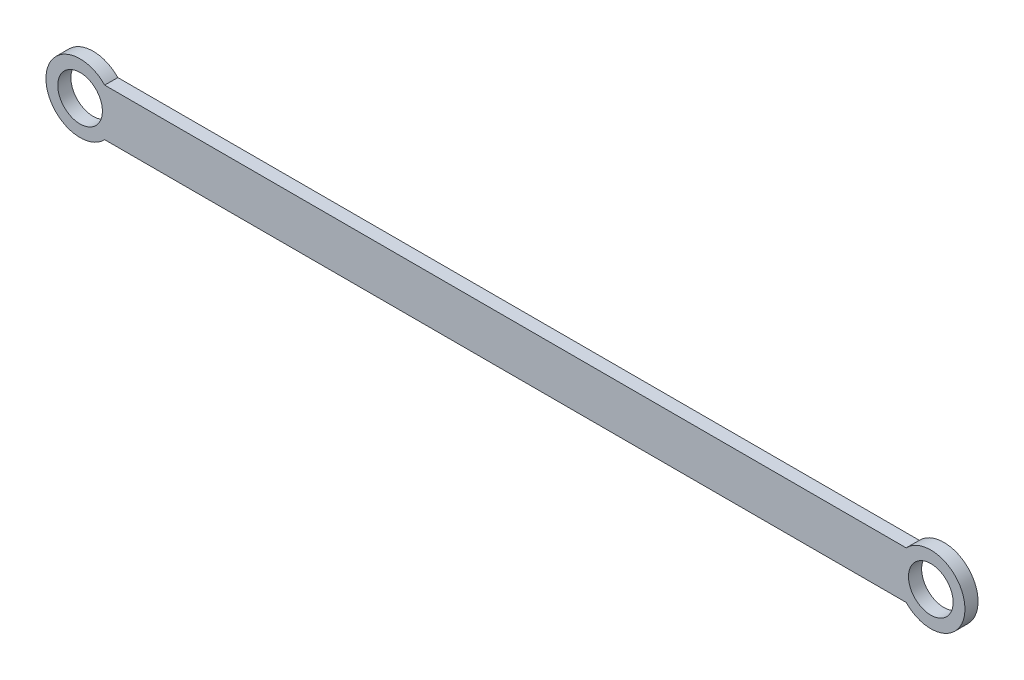
ISO-10303-21;
HEADER;
FILE_DESCRIPTION(('STEP AP214'),'2;1');
FILE_NAME('part.step','',(''),(''),'','','');
FILE_SCHEMA(('AUTOMOTIVE_DESIGN { 1 0 10303 214 1 1 1 1 }'));
ENDSEC;
DATA;
#1=APPLICATION_CONTEXT('core data for automotive mechanical design processes');
#2=APPLICATION_PROTOCOL_DEFINITION('international standard','automotive_design',2000,#1);
#3=PRODUCT_CONTEXT('',#1,'mechanical');
#4=PRODUCT('Part','Part','',(#3));
#5=PRODUCT_RELATED_PRODUCT_CATEGORY('part','',(#4));
#6=PRODUCT_DEFINITION_FORMATION('','',#4);
#7=PRODUCT_DEFINITION_CONTEXT('part definition',#1,'design');
#8=PRODUCT_DEFINITION('design','',#6,#7);
#9=PRODUCT_DEFINITION_SHAPE('','',#8);
#10=(LENGTH_UNIT() NAMED_UNIT(*) SI_UNIT(.MILLI.,.METRE.));
#11=(NAMED_UNIT(*) PLANE_ANGLE_UNIT() SI_UNIT($,.RADIAN.));
#12=(NAMED_UNIT(*) SI_UNIT($,.STERADIAN.) SOLID_ANGLE_UNIT());
#13=UNCERTAINTY_MEASURE_WITH_UNIT(LENGTH_MEASURE(1.E-05),#10,'distance_accuracy_value','');
#14=(GEOMETRIC_REPRESENTATION_CONTEXT(3) GLOBAL_UNCERTAINTY_ASSIGNED_CONTEXT((#13)) GLOBAL_UNIT_ASSIGNED_CONTEXT((#10,
#11,#12)) REPRESENTATION_CONTEXT('',''));
#15=CARTESIAN_POINT('',(0.,0.,0.));
#16=DIRECTION('',(0.,0.,1.));
#17=DIRECTION('',(1.,0.,0.));
#18=AXIS2_PLACEMENT_3D('',#15,#16,#17);
#19=CARTESIAN_POINT('',(0.,0.,2.5));
#20=DIRECTION('',(0.,0.,1.));
#21=DIRECTION('',(1.,0.,0.));
#22=AXIS2_PLACEMENT_3D('',#19,#20,#21);
#23=PLANE('',#22);
#24=CARTESIAN_POINT('',(0.,0.,2.5));
#25=DIRECTION('',(0.,0.,1.));
#26=DIRECTION('',(1.,0.,0.));
#27=AXIS2_PLACEMENT_3D('',#24,#25,#26);
#28=CIRCLE('',#27,4.25);
#29=CARTESIAN_POINT('',(4.25,0.,2.5));
#30=VERTEX_POINT('',#29);
#31=EDGE_CURVE('E112',#30,#30,#28,.T.);
#32=ORIENTED_EDGE('',*,*,#31,.F.);
#33=EDGE_LOOP('',(#32));
#34=FACE_BOUND('',#33,.T.);
#35=CARTESIAN_POINT('',(0.,0.,2.5));
#36=DIRECTION('',(0.,0.,1.));
#37=DIRECTION('',(1.,0.,0.));
#38=AXIS2_PLACEMENT_3D('',#35,#36,#37);
#39=CIRCLE('',#38,6.5);
#40=CARTESIAN_POINT('',(4.69041575982343,4.5,2.5));
#41=VERTEX_POINT('',#40);
#42=CARTESIAN_POINT('',(4.69041575982343,-4.5,2.5));
#43=VERTEX_POINT('',#42);
#44=EDGE_CURVE('E92',#41,#43,#39,.T.);
#45=ORIENTED_EDGE('',*,*,#44,.T.);
#46=DIRECTION('',(1.,0.,0.));
#47=VECTOR('',#46,1.);
#48=CARTESIAN_POINT('',(4.69041575982343,-4.5,2.5));
#49=LINE('',#48,#47);
#50=CARTESIAN_POINT('',(157.309584240177,-4.5,2.5));
#51=VERTEX_POINT('',#50);
#52=EDGE_CURVE('E87',#43,#51,#49,.T.);
#53=ORIENTED_EDGE('',*,*,#52,.T.);
#54=CARTESIAN_POINT('',(162.,0.,2.5));
#55=DIRECTION('',(0.,0.,1.));
#56=DIRECTION('',(1.,0.,0.));
#57=AXIS2_PLACEMENT_3D('',#54,#55,#56);
#58=CIRCLE('',#57,6.5);
#59=CARTESIAN_POINT('',(157.309584240177,4.5,2.5));
#60=VERTEX_POINT('',#59);
#61=EDGE_CURVE('E90',#51,#60,#58,.T.);
#62=ORIENTED_EDGE('',*,*,#61,.T.);
#63=DIRECTION('',(-1.,0.,0.));
#64=VECTOR('',#63,1.);
#65=CARTESIAN_POINT('',(4.69041575982343,4.5,2.5));
#66=LINE('',#65,#64);
#67=EDGE_CURVE('E57',#60,#41,#66,.T.);
#68=ORIENTED_EDGE('',*,*,#67,.T.);
#69=EDGE_LOOP('',(#45,#53,#62,#68));
#70=FACE_BOUND('',#69,.T.);
#71=CARTESIAN_POINT('',(162.,0.,2.5));
#72=DIRECTION('',(0.,0.,1.));
#73=DIRECTION('',(1.,0.,0.));
#74=AXIS2_PLACEMENT_3D('',#71,#72,#73);
#75=CIRCLE('',#74,4.25000000000001);
#76=CARTESIAN_POINT('',(166.25,0.,2.5));
#77=VERTEX_POINT('',#76);
#78=EDGE_CURVE('E134',#77,#77,#75,.T.);
#79=ORIENTED_EDGE('',*,*,#78,.F.);
#80=EDGE_LOOP('',(#79));
#81=FACE_BOUND('',#80,.T.);
#82=ADVANCED_FACE('F39',(#34,#70,#81),#23,.T.);
#83=CARTESIAN_POINT('',(0.,0.,0.));
#84=DIRECTION('',(0.,0.,1.));
#85=DIRECTION('',(1.,0.,0.));
#86=AXIS2_PLACEMENT_3D('',#83,#84,#85);
#87=PLANE('',#86);
#88=CARTESIAN_POINT('',(0.,0.,0.));
#89=DIRECTION('',(0.,0.,1.));
#90=DIRECTION('',(1.,0.,0.));
#91=AXIS2_PLACEMENT_3D('',#88,#89,#90);
#92=CIRCLE('',#91,6.5);
#93=CARTESIAN_POINT('',(4.69041575982343,4.5,0.));
#94=VERTEX_POINT('',#93);
#95=CARTESIAN_POINT('',(4.69041575982343,-4.5,0.));
#96=VERTEX_POINT('',#95);
#97=EDGE_CURVE('E108',#94,#96,#92,.T.);
#98=ORIENTED_EDGE('',*,*,#97,.F.);
#99=DIRECTION('',(-1.,0.,0.));
#100=VECTOR('',#99,1.);
#101=CARTESIAN_POINT('',(4.69041575982343,4.5,0.));
#102=LINE('',#101,#100);
#103=CARTESIAN_POINT('',(157.309584240177,4.5,0.));
#104=VERTEX_POINT('',#103);
#105=EDGE_CURVE('E80',#104,#94,#102,.T.);
#106=ORIENTED_EDGE('',*,*,#105,.F.);
#107=CARTESIAN_POINT('',(162.,0.,0.));
#108=DIRECTION('',(0.,0.,1.));
#109=DIRECTION('',(1.,0.,0.));
#110=AXIS2_PLACEMENT_3D('',#107,#108,#109);
#111=CIRCLE('',#110,6.5);
#112=CARTESIAN_POINT('',(157.309584240177,-4.5,0.));
#113=VERTEX_POINT('',#112);
#114=EDGE_CURVE('E74',#113,#104,#111,.T.);
#115=ORIENTED_EDGE('',*,*,#114,.F.);
#116=DIRECTION('',(1.,0.,0.));
#117=VECTOR('',#116,1.);
#118=CARTESIAN_POINT('',(4.69041575982343,-4.5,0.));
#119=LINE('',#118,#117);
#120=EDGE_CURVE('E97',#96,#113,#119,.T.);
#121=ORIENTED_EDGE('',*,*,#120,.F.);
#122=EDGE_LOOP('',(#98,#106,#115,#121));
#123=FACE_BOUND('',#122,.T.);
#124=CARTESIAN_POINT('',(0.,0.,0.));
#125=DIRECTION('',(0.,0.,1.));
#126=DIRECTION('',(1.,0.,0.));
#127=AXIS2_PLACEMENT_3D('',#124,#125,#126);
#128=CIRCLE('',#127,4.25);
#129=CARTESIAN_POINT('',(4.25,0.,0.));
#130=VERTEX_POINT('',#129);
#131=EDGE_CURVE('E130',#130,#130,#128,.T.);
#132=ORIENTED_EDGE('',*,*,#131,.T.);
#133=EDGE_LOOP('',(#132));
#134=FACE_BOUND('',#133,.T.);
#135=CARTESIAN_POINT('',(162.,0.,0.));
#136=DIRECTION('',(0.,0.,1.));
#137=DIRECTION('',(1.,0.,0.));
#138=AXIS2_PLACEMENT_3D('',#135,#136,#137);
#139=CIRCLE('',#138,4.25000000000001);
#140=CARTESIAN_POINT('',(166.25,0.,0.));
#141=VERTEX_POINT('',#140);
#142=EDGE_CURVE('E138',#141,#141,#139,.T.);
#143=ORIENTED_EDGE('',*,*,#142,.T.);
#144=EDGE_LOOP('',(#143));
#145=FACE_BOUND('',#144,.T.);
#146=ADVANCED_FACE('F125',(#123,#134,#145),#87,.F.);
#147=CARTESIAN_POINT('',(0.,0.,2.5));
#148=DIRECTION('',(0.,0.,-1.));
#149=DIRECTION('',(-1.,0.,0.));
#150=AXIS2_PLACEMENT_3D('',#147,#148,#149);
#151=CYLINDRICAL_SURFACE('',#150,6.5);
#152=ORIENTED_EDGE('',*,*,#97,.T.);
#153=DIRECTION('',(0.,0.,-1.));
#154=VECTOR('',#153,1.);
#155=CARTESIAN_POINT('',(4.69041575982343,-4.5,2.5));
#156=LINE('',#155,#154);
#157=EDGE_CURVE('E11',#43,#96,#156,.T.);
#158=ORIENTED_EDGE('',*,*,#157,.F.);
#159=ORIENTED_EDGE('',*,*,#44,.F.);
#160=DIRECTION('',(0.,0.,-1.));
#161=VECTOR('',#160,1.);
#162=CARTESIAN_POINT('',(4.69041575982343,4.5,2.5));
#163=LINE('',#162,#161);
#164=EDGE_CURVE('E104',#41,#94,#163,.T.);
#165=ORIENTED_EDGE('',*,*,#164,.T.);
#166=EDGE_LOOP('',(#152,#158,#159,#165));
#167=FACE_BOUND('',#166,.T.);
#168=ADVANCED_FACE('F41',(#167),#151,.T.);
#169=CARTESIAN_POINT('',(4.69041575982343,-4.5,2.5));
#170=DIRECTION('',(0.,1.,0.));
#171=DIRECTION('',(0.,0.,1.));
#172=AXIS2_PLACEMENT_3D('',#169,#170,#171);
#173=PLANE('',#172);
#174=ORIENTED_EDGE('',*,*,#120,.T.);
#175=DIRECTION('',(0.,0.,-1.));
#176=VECTOR('',#175,1.);
#177=CARTESIAN_POINT('',(157.309584240177,-4.5,2.5));
#178=LINE('',#177,#176);
#179=EDGE_CURVE('E49',#51,#113,#178,.T.);
#180=ORIENTED_EDGE('',*,*,#179,.F.);
#181=ORIENTED_EDGE('',*,*,#52,.F.);
#182=ORIENTED_EDGE('',*,*,#157,.T.);
#183=EDGE_LOOP('',(#174,#180,#181,#182));
#184=FACE_BOUND('',#183,.T.);
#185=ADVANCED_FACE('F96',(#184),#173,.F.);
#186=CARTESIAN_POINT('',(162.,0.,2.5));
#187=DIRECTION('',(0.,0.,-1.));
#188=DIRECTION('',(-1.,0.,0.));
#189=AXIS2_PLACEMENT_3D('',#186,#187,#188);
#190=CYLINDRICAL_SURFACE('',#189,6.5);
#191=ORIENTED_EDGE('',*,*,#114,.T.);
#192=DIRECTION('',(0.,0.,-1.));
#193=VECTOR('',#192,1.);
#194=CARTESIAN_POINT('',(157.309584240177,4.5,2.5));
#195=LINE('',#194,#193);
#196=EDGE_CURVE('E99',#60,#104,#195,.T.);
#197=ORIENTED_EDGE('',*,*,#196,.F.);
#198=ORIENTED_EDGE('',*,*,#61,.F.);
#199=ORIENTED_EDGE('',*,*,#179,.T.);
#200=EDGE_LOOP('',(#191,#197,#198,#199));
#201=FACE_BOUND('',#200,.T.);
#202=ADVANCED_FACE('F100',(#201),#190,.T.);
#203=CARTESIAN_POINT('',(4.69041575982343,4.5,2.5));
#204=DIRECTION('',(0.,-1.,0.));
#205=DIRECTION('',(0.,0.,-1.));
#206=AXIS2_PLACEMENT_3D('',#203,#204,#205);
#207=PLANE('',#206);
#208=ORIENTED_EDGE('',*,*,#105,.T.);
#209=ORIENTED_EDGE('',*,*,#164,.F.);
#210=ORIENTED_EDGE('',*,*,#67,.F.);
#211=ORIENTED_EDGE('',*,*,#196,.T.);
#212=EDGE_LOOP('',(#208,#209,#210,#211));
#213=FACE_BOUND('',#212,.T.);
#214=ADVANCED_FACE('F122',(#213),#207,.F.);
#215=CARTESIAN_POINT('',(0.,0.,2.5));
#216=DIRECTION('',(0.,0.,-1.));
#217=DIRECTION('',(-1.,0.,0.));
#218=AXIS2_PLACEMENT_3D('',#215,#216,#217);
#219=CYLINDRICAL_SURFACE('',#218,4.25);
#220=ORIENTED_EDGE('',*,*,#31,.T.);
#221=EDGE_LOOP('',(#220));
#222=FACE_BOUND('',#221,.T.);
#223=ORIENTED_EDGE('',*,*,#131,.F.);
#224=EDGE_LOOP('',(#223));
#225=FACE_BOUND('',#224,.T.);
#226=ADVANCED_FACE('F157',(#222,#225),#219,.F.);
#227=CARTESIAN_POINT('',(162.,0.,2.5));
#228=DIRECTION('',(0.,0.,-1.));
#229=DIRECTION('',(-1.,0.,0.));
#230=AXIS2_PLACEMENT_3D('',#227,#228,#229);
#231=CYLINDRICAL_SURFACE('',#230,4.25000000000001);
#232=ORIENTED_EDGE('',*,*,#78,.T.);
#233=EDGE_LOOP('',(#232));
#234=FACE_BOUND('',#233,.T.);
#235=ORIENTED_EDGE('',*,*,#142,.F.);
#236=EDGE_LOOP('',(#235));
#237=FACE_BOUND('',#236,.T.);
#238=ADVANCED_FACE('F146',(#234,#237),#231,.F.);
#239=CLOSED_SHELL('',(#82,#146,#168,#185,#202,#214,#226,#238));
#240=MANIFOLD_SOLID_BREP('B2',#239);
#241=ADVANCED_BREP_SHAPE_REPRESENTATION('',(#18,#240),#14);
#242=SHAPE_DEFINITION_REPRESENTATION(#9,#241);
ENDSEC;
END-ISO-10303-21;
